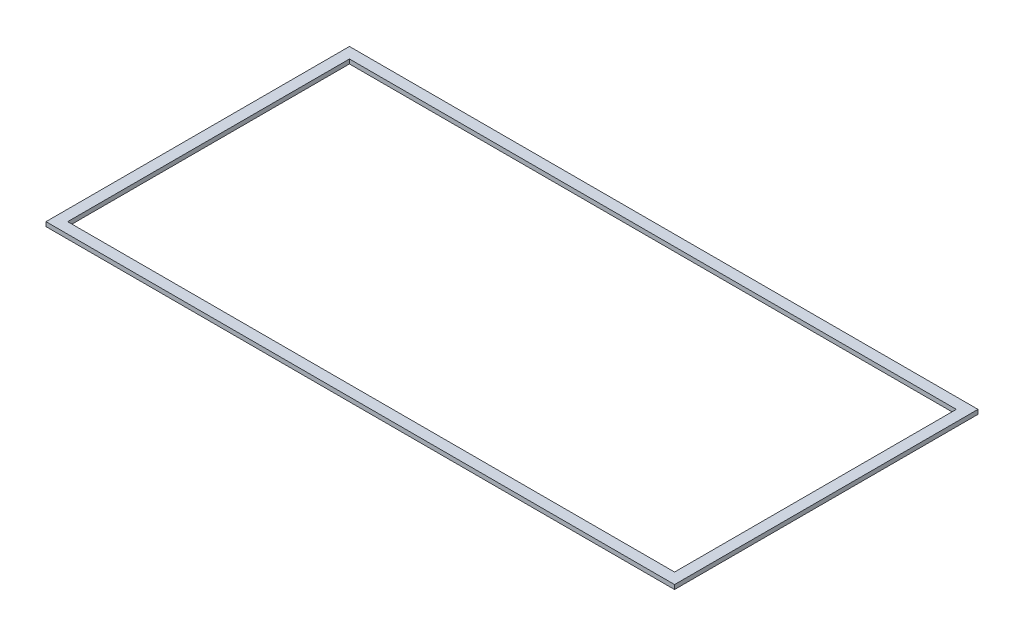
ISO-10303-21;
HEADER;
FILE_DESCRIPTION(('STEP AP214'),'2;1');
FILE_NAME('part.step','',(''),(''),'','','');
FILE_SCHEMA(('AUTOMOTIVE_DESIGN { 1 0 10303 214 1 1 1 1 }'));
ENDSEC;
DATA;
#1=APPLICATION_CONTEXT('core data for automotive mechanical design processes');
#2=APPLICATION_PROTOCOL_DEFINITION('international standard','automotive_design',2000,#1);
#3=PRODUCT_CONTEXT('',#1,'mechanical');
#4=PRODUCT('Part','Part','',(#3));
#5=PRODUCT_RELATED_PRODUCT_CATEGORY('part','',(#4));
#6=PRODUCT_DEFINITION_FORMATION('','',#4);
#7=PRODUCT_DEFINITION_CONTEXT('part definition',#1,'design');
#8=PRODUCT_DEFINITION('design','',#6,#7);
#9=PRODUCT_DEFINITION_SHAPE('','',#8);
#10=(LENGTH_UNIT() NAMED_UNIT(*) SI_UNIT(.MILLI.,.METRE.));
#11=(NAMED_UNIT(*) PLANE_ANGLE_UNIT() SI_UNIT($,.RADIAN.));
#12=(NAMED_UNIT(*) SI_UNIT($,.STERADIAN.) SOLID_ANGLE_UNIT());
#13=UNCERTAINTY_MEASURE_WITH_UNIT(LENGTH_MEASURE(1.E-05),#10,'distance_accuracy_value','');
#14=(GEOMETRIC_REPRESENTATION_CONTEXT(3) GLOBAL_UNCERTAINTY_ASSIGNED_CONTEXT((#13)) GLOBAL_UNIT_ASSIGNED_CONTEXT((#10,
#11,#12)) REPRESENTATION_CONTEXT('',''));
#15=CARTESIAN_POINT('',(0.,0.,0.));
#16=DIRECTION('',(0.,0.,1.));
#17=DIRECTION('',(1.,0.,0.));
#18=AXIS2_PLACEMENT_3D('',#15,#16,#17);
#19=CARTESIAN_POINT('',(0.,2.,0.));
#20=DIRECTION('',(0.,-1.,0.));
#21=DIRECTION('',(0.,0.,-1.));
#22=AXIS2_PLACEMENT_3D('',#19,#20,#21);
#23=PLANE('',#22);
#24=DIRECTION('',(0.,0.,-1.));
#25=VECTOR('',#24,1.);
#26=CARTESIAN_POINT('',(145.,2.,70.));
#27=LINE('',#26,#25);
#28=CARTESIAN_POINT('',(145.,2.,70.));
#29=VERTEX_POINT('',#28);
#30=CARTESIAN_POINT('',(145.,2.,-70.));
#31=VERTEX_POINT('',#30);
#32=EDGE_CURVE('E137',#29,#31,#27,.T.);
#33=ORIENTED_EDGE('',*,*,#32,.T.);
#34=DIRECTION('',(-1.,0.,0.));
#35=VECTOR('',#34,1.);
#36=CARTESIAN_POINT('',(-145.,2.,-70.));
#37=LINE('',#36,#35);
#38=CARTESIAN_POINT('',(-145.,2.,-70.));
#39=VERTEX_POINT('',#38);
#40=EDGE_CURVE('E140',#31,#39,#37,.T.);
#41=ORIENTED_EDGE('',*,*,#40,.T.);
#42=DIRECTION('',(0.,0.,1.));
#43=VECTOR('',#42,1.);
#44=CARTESIAN_POINT('',(-145.,2.,70.));
#45=LINE('',#44,#43);
#46=CARTESIAN_POINT('',(-145.,2.,70.));
#47=VERTEX_POINT('',#46);
#48=EDGE_CURVE('E143',#39,#47,#45,.T.);
#49=ORIENTED_EDGE('',*,*,#48,.T.);
#50=DIRECTION('',(1.,0.,0.));
#51=VECTOR('',#50,1.);
#52=CARTESIAN_POINT('',(-145.,2.,70.));
#53=LINE('',#52,#51);
#54=EDGE_CURVE('E145',#47,#29,#53,.T.);
#55=ORIENTED_EDGE('',*,*,#54,.T.);
#56=EDGE_LOOP('',(#33,#41,#49,#55));
#57=FACE_BOUND('',#56,.T.);
#58=DIRECTION('',(0.,0.,-1.));
#59=VECTOR('',#58,1.);
#60=CARTESIAN_POINT('',(140.,2.,65.));
#61=LINE('',#60,#59);
#62=CARTESIAN_POINT('',(140.,2.,65.));
#63=VERTEX_POINT('',#62);
#64=CARTESIAN_POINT('',(140.,2.,-65.));
#65=VERTEX_POINT('',#64);
#66=EDGE_CURVE('E101',#63,#65,#61,.T.);
#67=ORIENTED_EDGE('',*,*,#66,.F.);
#68=DIRECTION('',(1.,0.,0.));
#69=VECTOR('',#68,1.);
#70=CARTESIAN_POINT('',(-140.,2.,65.));
#71=LINE('',#70,#69);
#72=CARTESIAN_POINT('',(-140.,2.,65.));
#73=VERTEX_POINT('',#72);
#74=EDGE_CURVE('E123',#73,#63,#71,.T.);
#75=ORIENTED_EDGE('',*,*,#74,.F.);
#76=DIRECTION('',(0.,0.,1.));
#77=VECTOR('',#76,1.);
#78=CARTESIAN_POINT('',(-140.,2.,65.));
#79=LINE('',#78,#77);
#80=CARTESIAN_POINT('',(-140.,2.,-65.));
#81=VERTEX_POINT('',#80);
#82=EDGE_CURVE('E121',#81,#73,#79,.T.);
#83=ORIENTED_EDGE('',*,*,#82,.F.);
#84=DIRECTION('',(-1.,0.,0.));
#85=VECTOR('',#84,1.);
#86=CARTESIAN_POINT('',(-140.,2.,-65.));
#87=LINE('',#86,#85);
#88=EDGE_CURVE('E109',#65,#81,#87,.T.);
#89=ORIENTED_EDGE('',*,*,#88,.F.);
#90=EDGE_LOOP('',(#67,#75,#83,#89));
#91=FACE_BOUND('',#90,.T.);
#92=ADVANCED_FACE('F36',(#57,#91),#23,.F.);
#93=CARTESIAN_POINT('',(0.,0.,0.));
#94=DIRECTION('',(0.,-1.,0.));
#95=DIRECTION('',(0.,0.,-1.));
#96=AXIS2_PLACEMENT_3D('',#93,#94,#95);
#97=PLANE('',#96);
#98=DIRECTION('',(0.,0.,-1.));
#99=VECTOR('',#98,1.);
#100=CARTESIAN_POINT('',(145.,0.,70.));
#101=LINE('',#100,#99);
#102=CARTESIAN_POINT('',(145.,0.,70.));
#103=VERTEX_POINT('',#102);
#104=CARTESIAN_POINT('',(145.,0.,-70.));
#105=VERTEX_POINT('',#104);
#106=EDGE_CURVE('E117',#103,#105,#101,.T.);
#107=ORIENTED_EDGE('',*,*,#106,.F.);
#108=DIRECTION('',(1.,0.,0.));
#109=VECTOR('',#108,1.);
#110=CARTESIAN_POINT('',(-145.,0.,70.));
#111=LINE('',#110,#109);
#112=CARTESIAN_POINT('',(-145.,0.,70.));
#113=VERTEX_POINT('',#112);
#114=EDGE_CURVE('E141',#113,#103,#111,.T.);
#115=ORIENTED_EDGE('',*,*,#114,.F.);
#116=DIRECTION('',(0.,0.,1.));
#117=VECTOR('',#116,1.);
#118=CARTESIAN_POINT('',(-145.,0.,70.));
#119=LINE('',#118,#117);
#120=CARTESIAN_POINT('',(-145.,0.,-70.));
#121=VERTEX_POINT('',#120);
#122=EDGE_CURVE('E152',#121,#113,#119,.T.);
#123=ORIENTED_EDGE('',*,*,#122,.F.);
#124=DIRECTION('',(-1.,0.,0.));
#125=VECTOR('',#124,1.);
#126=CARTESIAN_POINT('',(-145.,0.,-70.));
#127=LINE('',#126,#125);
#128=EDGE_CURVE('E150',#105,#121,#127,.T.);
#129=ORIENTED_EDGE('',*,*,#128,.F.);
#130=EDGE_LOOP('',(#107,#115,#123,#129));
#131=FACE_BOUND('',#130,.T.);
#132=DIRECTION('',(1.,0.,0.));
#133=VECTOR('',#132,1.);
#134=CARTESIAN_POINT('',(-140.,0.,65.));
#135=LINE('',#134,#133);
#136=CARTESIAN_POINT('',(-140.,0.,65.));
#137=VERTEX_POINT('',#136);
#138=CARTESIAN_POINT('',(140.,0.,65.));
#139=VERTEX_POINT('',#138);
#140=EDGE_CURVE('E110',#137,#139,#135,.T.);
#141=ORIENTED_EDGE('',*,*,#140,.T.);
#142=DIRECTION('',(0.,0.,-1.));
#143=VECTOR('',#142,1.);
#144=CARTESIAN_POINT('',(140.,0.,65.));
#145=LINE('',#144,#143);
#146=CARTESIAN_POINT('',(140.,0.,-65.));
#147=VERTEX_POINT('',#146);
#148=EDGE_CURVE('E59',#139,#147,#145,.T.);
#149=ORIENTED_EDGE('',*,*,#148,.T.);
#150=DIRECTION('',(-1.,0.,0.));
#151=VECTOR('',#150,1.);
#152=CARTESIAN_POINT('',(-140.,0.,-65.));
#153=LINE('',#152,#151);
#154=CARTESIAN_POINT('',(-140.,0.,-65.));
#155=VERTEX_POINT('',#154);
#156=EDGE_CURVE('E116',#147,#155,#153,.T.);
#157=ORIENTED_EDGE('',*,*,#156,.T.);
#158=DIRECTION('',(0.,0.,1.));
#159=VECTOR('',#158,1.);
#160=CARTESIAN_POINT('',(-140.,0.,65.));
#161=LINE('',#160,#159);
#162=EDGE_CURVE('E129',#155,#137,#161,.T.);
#163=ORIENTED_EDGE('',*,*,#162,.T.);
#164=EDGE_LOOP('',(#141,#149,#157,#163));
#165=FACE_BOUND('',#164,.T.);
#166=ADVANCED_FACE('F170',(#131,#165),#97,.T.);
#167=CARTESIAN_POINT('',(145.,2.,70.));
#168=DIRECTION('',(-1.,0.,0.));
#169=DIRECTION('',(0.,0.,1.));
#170=AXIS2_PLACEMENT_3D('',#167,#168,#169);
#171=PLANE('',#170);
#172=ORIENTED_EDGE('',*,*,#106,.T.);
#173=DIRECTION('',(0.,-1.,0.));
#174=VECTOR('',#173,1.);
#175=CARTESIAN_POINT('',(145.,2.,-70.));
#176=LINE('',#175,#174);
#177=EDGE_CURVE('E11',#31,#105,#176,.T.);
#178=ORIENTED_EDGE('',*,*,#177,.F.);
#179=ORIENTED_EDGE('',*,*,#32,.F.);
#180=DIRECTION('',(0.,-1.,0.));
#181=VECTOR('',#180,1.);
#182=CARTESIAN_POINT('',(145.,2.,70.));
#183=LINE('',#182,#181);
#184=EDGE_CURVE('E147',#29,#103,#183,.T.);
#185=ORIENTED_EDGE('',*,*,#184,.T.);
#186=EDGE_LOOP('',(#172,#178,#179,#185));
#187=FACE_BOUND('',#186,.T.);
#188=ADVANCED_FACE('F38',(#187),#171,.F.);
#189=CARTESIAN_POINT('',(-145.,2.,-70.));
#190=DIRECTION('',(0.,0.,1.));
#191=DIRECTION('',(1.,0.,0.));
#192=AXIS2_PLACEMENT_3D('',#189,#190,#191);
#193=PLANE('',#192);
#194=ORIENTED_EDGE('',*,*,#128,.T.);
#195=DIRECTION('',(0.,-1.,0.));
#196=VECTOR('',#195,1.);
#197=CARTESIAN_POINT('',(-145.,2.,-70.));
#198=LINE('',#197,#196);
#199=EDGE_CURVE('E44',#39,#121,#198,.T.);
#200=ORIENTED_EDGE('',*,*,#199,.F.);
#201=ORIENTED_EDGE('',*,*,#40,.F.);
#202=ORIENTED_EDGE('',*,*,#177,.T.);
#203=EDGE_LOOP('',(#194,#200,#201,#202));
#204=FACE_BOUND('',#203,.T.);
#205=ADVANCED_FACE('F180',(#204),#193,.F.);
#206=CARTESIAN_POINT('',(-145.,2.,70.));
#207=DIRECTION('',(1.,0.,0.));
#208=DIRECTION('',(0.,0.,-1.));
#209=AXIS2_PLACEMENT_3D('',#206,#207,#208);
#210=PLANE('',#209);
#211=ORIENTED_EDGE('',*,*,#122,.T.);
#212=DIRECTION('',(0.,-1.,0.));
#213=VECTOR('',#212,1.);
#214=CARTESIAN_POINT('',(-145.,2.,70.));
#215=LINE('',#214,#213);
#216=EDGE_CURVE('E157',#47,#113,#215,.T.);
#217=ORIENTED_EDGE('',*,*,#216,.F.);
#218=ORIENTED_EDGE('',*,*,#48,.F.);
#219=ORIENTED_EDGE('',*,*,#199,.T.);
#220=EDGE_LOOP('',(#211,#217,#218,#219));
#221=FACE_BOUND('',#220,.T.);
#222=ADVANCED_FACE('F164',(#221),#210,.F.);
#223=CARTESIAN_POINT('',(-145.,2.,70.));
#224=DIRECTION('',(0.,0.,-1.));
#225=DIRECTION('',(-1.,0.,0.));
#226=AXIS2_PLACEMENT_3D('',#223,#224,#225);
#227=PLANE('',#226);
#228=ORIENTED_EDGE('',*,*,#114,.T.);
#229=ORIENTED_EDGE('',*,*,#184,.F.);
#230=ORIENTED_EDGE('',*,*,#54,.F.);
#231=ORIENTED_EDGE('',*,*,#216,.T.);
#232=EDGE_LOOP('',(#228,#229,#230,#231));
#233=FACE_BOUND('',#232,.T.);
#234=ADVANCED_FACE('F174',(#233),#227,.F.);
#235=CARTESIAN_POINT('',(140.,2.,65.));
#236=DIRECTION('',(-1.,0.,0.));
#237=DIRECTION('',(0.,0.,1.));
#238=AXIS2_PLACEMENT_3D('',#235,#236,#237);
#239=PLANE('',#238);
#240=ORIENTED_EDGE('',*,*,#148,.F.);
#241=DIRECTION('',(0.,-1.,0.));
#242=VECTOR('',#241,1.);
#243=CARTESIAN_POINT('',(140.,2.,65.));
#244=LINE('',#243,#242);
#245=EDGE_CURVE('E105',#63,#139,#244,.T.);
#246=ORIENTED_EDGE('',*,*,#245,.F.);
#247=ORIENTED_EDGE('',*,*,#66,.T.);
#248=DIRECTION('',(0.,-1.,0.));
#249=VECTOR('',#248,1.);
#250=CARTESIAN_POINT('',(140.,2.,-65.));
#251=LINE('',#250,#249);
#252=EDGE_CURVE('E104',#65,#147,#251,.T.);
#253=ORIENTED_EDGE('',*,*,#252,.T.);
#254=EDGE_LOOP('',(#240,#246,#247,#253));
#255=FACE_BOUND('',#254,.T.);
#256=ADVANCED_FACE('F103',(#255),#239,.T.);
#257=CARTESIAN_POINT('',(-140.,2.,-65.));
#258=DIRECTION('',(0.,0.,1.));
#259=DIRECTION('',(1.,0.,0.));
#260=AXIS2_PLACEMENT_3D('',#257,#258,#259);
#261=PLANE('',#260);
#262=ORIENTED_EDGE('',*,*,#156,.F.);
#263=ORIENTED_EDGE('',*,*,#252,.F.);
#264=ORIENTED_EDGE('',*,*,#88,.T.);
#265=DIRECTION('',(0.,-1.,0.));
#266=VECTOR('',#265,1.);
#267=CARTESIAN_POINT('',(-140.,2.,-65.));
#268=LINE('',#267,#266);
#269=EDGE_CURVE('E118',#81,#155,#268,.T.);
#270=ORIENTED_EDGE('',*,*,#269,.T.);
#271=EDGE_LOOP('',(#262,#263,#264,#270));
#272=FACE_BOUND('',#271,.T.);
#273=ADVANCED_FACE('F113',(#272),#261,.T.);
#274=CARTESIAN_POINT('',(-140.,2.,65.));
#275=DIRECTION('',(1.,0.,0.));
#276=DIRECTION('',(0.,0.,-1.));
#277=AXIS2_PLACEMENT_3D('',#274,#275,#276);
#278=PLANE('',#277);
#279=ORIENTED_EDGE('',*,*,#162,.F.);
#280=ORIENTED_EDGE('',*,*,#269,.F.);
#281=ORIENTED_EDGE('',*,*,#82,.T.);
#282=DIRECTION('',(0.,-1.,0.));
#283=VECTOR('',#282,1.);
#284=CARTESIAN_POINT('',(-140.,2.,65.));
#285=LINE('',#284,#283);
#286=EDGE_CURVE('E51',#73,#137,#285,.T.);
#287=ORIENTED_EDGE('',*,*,#286,.T.);
#288=EDGE_LOOP('',(#279,#280,#281,#287));
#289=FACE_BOUND('',#288,.T.);
#290=ADVANCED_FACE('F203',(#289),#278,.T.);
#291=CARTESIAN_POINT('',(-140.,2.,65.));
#292=DIRECTION('',(0.,0.,-1.));
#293=DIRECTION('',(-1.,0.,0.));
#294=AXIS2_PLACEMENT_3D('',#291,#292,#293);
#295=PLANE('',#294);
#296=ORIENTED_EDGE('',*,*,#140,.F.);
#297=ORIENTED_EDGE('',*,*,#286,.F.);
#298=ORIENTED_EDGE('',*,*,#74,.T.);
#299=ORIENTED_EDGE('',*,*,#245,.T.);
#300=EDGE_LOOP('',(#296,#297,#298,#299));
#301=FACE_BOUND('',#300,.T.);
#302=ADVANCED_FACE('F207',(#301),#295,.T.);
#303=CLOSED_SHELL('',(#92,#166,#188,#205,#222,#234,#256,#273,#290,#302));
#304=MANIFOLD_SOLID_BREP('B2',#303);
#305=ADVANCED_BREP_SHAPE_REPRESENTATION('',(#18,#304),#14);
#306=SHAPE_DEFINITION_REPRESENTATION(#9,#305);
ENDSEC;
END-ISO-10303-21;
